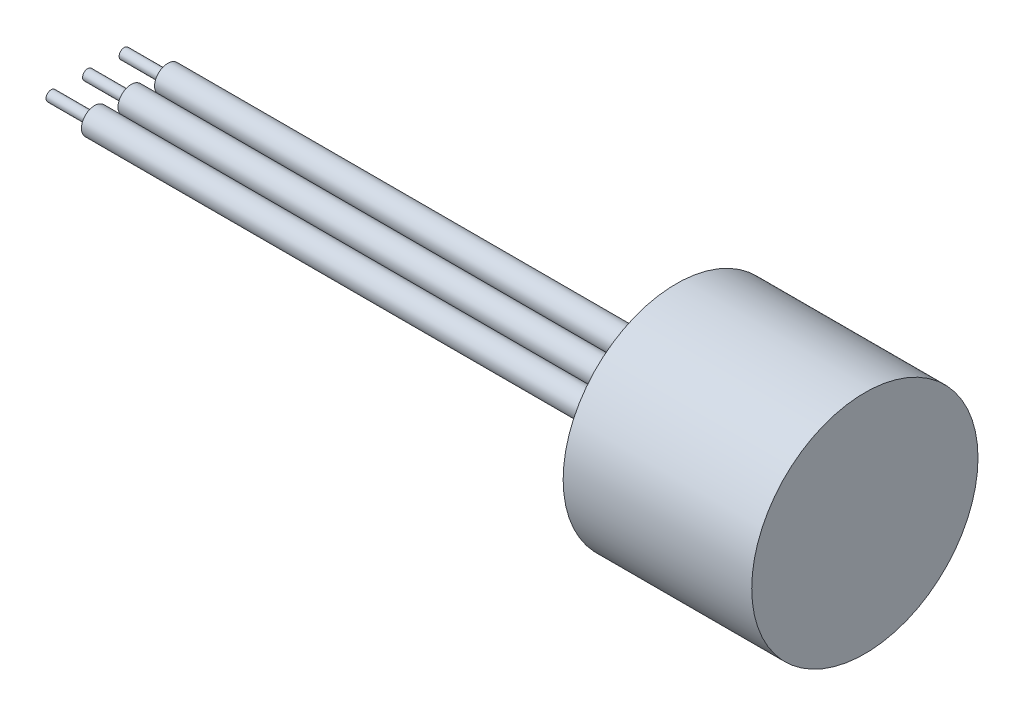
ISO-10303-21;
HEADER;
FILE_DESCRIPTION(('STEP AP214'),'2;1');
FILE_NAME('part.step','',(''),(''),'','','');
FILE_SCHEMA(('AUTOMOTIVE_DESIGN { 1 0 10303 214 1 1 1 1 }'));
ENDSEC;
DATA;
#1=APPLICATION_CONTEXT('core data for automotive mechanical design processes');
#2=APPLICATION_PROTOCOL_DEFINITION('international standard','automotive_design',2000,#1);
#3=PRODUCT_CONTEXT('',#1,'mechanical');
#4=PRODUCT('Part','Part','',(#3));
#5=PRODUCT_RELATED_PRODUCT_CATEGORY('part','',(#4));
#6=PRODUCT_DEFINITION_FORMATION('','',#4);
#7=PRODUCT_DEFINITION_CONTEXT('part definition',#1,'design');
#8=PRODUCT_DEFINITION('design','',#6,#7);
#9=PRODUCT_DEFINITION_SHAPE('','',#8);
#10=(LENGTH_UNIT() NAMED_UNIT(*) SI_UNIT(.MILLI.,.METRE.));
#11=(NAMED_UNIT(*) PLANE_ANGLE_UNIT() SI_UNIT($,.RADIAN.));
#12=(NAMED_UNIT(*) SI_UNIT($,.STERADIAN.) SOLID_ANGLE_UNIT());
#13=UNCERTAINTY_MEASURE_WITH_UNIT(LENGTH_MEASURE(1.E-05),#10,'distance_accuracy_value','');
#14=(GEOMETRIC_REPRESENTATION_CONTEXT(3) GLOBAL_UNCERTAINTY_ASSIGNED_CONTEXT((#13)) GLOBAL_UNIT_ASSIGNED_CONTEXT((#10,
#11,#12)) REPRESENTATION_CONTEXT('',''));
#15=CARTESIAN_POINT('',(0.,0.,0.));
#16=DIRECTION('',(0.,0.,1.));
#17=DIRECTION('',(1.,0.,0.));
#18=AXIS2_PLACEMENT_3D('',#15,#16,#17);
#19=CARTESIAN_POINT('',(35.6108,-12.191773113498,-0.094209599722346));
#20=DIRECTION('',(1.,0.,0.));
#21=DIRECTION('',(0.,0.,-1.));
#22=AXIS2_PLACEMENT_3D('',#19,#20,#21);
#23=PLANE('',#22);
#24=CARTESIAN_POINT('',(35.6108,-12.191772950524,-0.094209599722354));
#25=DIRECTION('',(1.,0.,0.));
#26=DIRECTION('',(0.,0.,-1.));
#27=AXIS2_PLACEMENT_3D('',#24,#25,#26);
#28=CIRCLE('',#27,1.46049991140565);
#29=CARTESIAN_POINT('',(35.6108,-12.191772950524,-1.554709511128));
#30=VERTEX_POINT('',#29);
#31=EDGE_CURVE('E10',#30,#30,#28,.F.);
#32=ORIENTED_EDGE('',*,*,#31,.F.);
#33=EDGE_LOOP('',(#32));
#34=FACE_BOUND('',#33,.T.);
#35=CARTESIAN_POINT('',(35.6108,-12.191772950524,-4.1582095997224));
#36=DIRECTION('',(1.,0.,0.));
#37=DIRECTION('',(0.,0.,-1.));
#38=AXIS2_PLACEMENT_3D('',#35,#36,#37);
#39=CIRCLE('',#38,1.46049991202145);
#40=CARTESIAN_POINT('',(35.6108,-12.191772950524,-5.61870951174385));
#41=VERTEX_POINT('',#40);
#42=EDGE_CURVE('E36',#41,#41,#39,.F.);
#43=ORIENTED_EDGE('',*,*,#42,.F.);
#44=EDGE_LOOP('',(#43));
#45=FACE_BOUND('',#44,.T.);
#46=CARTESIAN_POINT('',(35.6108,-12.191772950524,3.9697904002776));
#47=DIRECTION('',(1.,0.,0.));
#48=DIRECTION('',(0.,0.,-1.));
#49=AXIS2_PLACEMENT_3D('',#46,#47,#48);
#50=CIRCLE('',#49,1.46049991140565);
#51=CARTESIAN_POINT('',(35.6108,-12.191772950524,2.50929048887195));
#52=VERTEX_POINT('',#51);
#53=EDGE_CURVE('E40',#52,#52,#50,.F.);
#54=ORIENTED_EDGE('',*,*,#53,.F.);
#55=EDGE_LOOP('',(#54));
#56=FACE_BOUND('',#55,.T.);
#57=CARTESIAN_POINT('',(35.6108,-12.191773113498,-0.094209599722346));
#58=DIRECTION('',(-1.,0.,0.));
#59=DIRECTION('',(0.,0.,1.));
#60=AXIS2_PLACEMENT_3D('',#57,#58,#59);
#61=CIRCLE('',#60,7.1113758326624);
#62=CARTESIAN_POINT('',(35.6108,-12.191773113498,7.01716623294005));
#63=VERTEX_POINT('',#62);
#64=EDGE_CURVE('E44',#63,#63,#61,.T.);
#65=ORIENTED_EDGE('',*,*,#64,.T.);
#66=EDGE_LOOP('',(#65));
#67=FACE_BOUND('',#66,.T.);
#68=ADVANCED_FACE('F30',(#34,#45,#56,#67),#23,.F.);
#69=CARTESIAN_POINT('',(58.4708,-12.191773113498,-0.094209599722346));
#70=DIRECTION('',(-1.,0.,0.));
#71=DIRECTION('',(0.,0.,1.));
#72=AXIS2_PLACEMENT_3D('',#69,#70,#71);
#73=CYLINDRICAL_SURFACE('',#72,7.11137599563645);
#74=ORIENTED_EDGE('',*,*,#64,.F.);
#75=EDGE_LOOP('',(#74));
#76=FACE_BOUND('',#75,.T.);
#77=CARTESIAN_POINT('',(54.6608,-12.191773113498,-0.094209599722346));
#78=DIRECTION('',(-1.,0.,0.));
#79=DIRECTION('',(0.,0.,1.));
#80=AXIS2_PLACEMENT_3D('',#77,#78,#79);
#81=CIRCLE('',#80,7.1113761586105);
#82=CARTESIAN_POINT('',(54.6608,-12.191773113498,7.01716655888815));
#83=VERTEX_POINT('',#82);
#84=EDGE_CURVE('E49',#83,#83,#81,.T.);
#85=ORIENTED_EDGE('',*,*,#84,.T.);
#86=EDGE_LOOP('',(#85));
#87=FACE_BOUND('',#86,.T.);
#88=ADVANCED_FACE('F107',(#76,#87),#73,.T.);
#89=CARTESIAN_POINT('',(54.6608,-5.0803969548875,-0.094209599722346));
#90=DIRECTION('',(1.,0.,0.));
#91=DIRECTION('',(0.,0.,-1.));
#92=AXIS2_PLACEMENT_3D('',#89,#90,#91);
#93=PLANE('',#92);
#94=ORIENTED_EDGE('',*,*,#84,.F.);
#95=EDGE_LOOP('',(#94));
#96=FACE_BOUND('',#95,.T.);
#97=CARTESIAN_POINT('',(54.6608,-12.191773113498,-0.094209599722346));
#98=DIRECTION('',(-1.,0.,0.));
#99=DIRECTION('',(0.,0.,1.));
#100=AXIS2_PLACEMENT_3D('',#97,#98,#99);
#101=CIRCLE('',#100,9.3975179663575);
#102=CARTESIAN_POINT('',(54.6608,-12.191773113498,9.30330836663515));
#103=VERTEX_POINT('',#102);
#104=EDGE_CURVE('E52',#103,#103,#101,.T.);
#105=ORIENTED_EDGE('',*,*,#104,.T.);
#106=EDGE_LOOP('',(#105));
#107=FACE_BOUND('',#106,.T.);
#108=ADVANCED_FACE('F112',(#96,#107),#93,.F.);
#109=CARTESIAN_POINT('',(58.4708,-12.191773113498,-0.094209599722346));
#110=DIRECTION('',(-1.,0.,0.));
#111=DIRECTION('',(0.,0.,1.));
#112=AXIS2_PLACEMENT_3D('',#109,#110,#111);
#113=CYLINDRICAL_SURFACE('',#112,9.39752295933295);
#114=ORIENTED_EDGE('',*,*,#104,.F.);
#115=EDGE_LOOP('',(#114));
#116=FACE_BOUND('',#115,.T.);
#117=CARTESIAN_POINT('',(39.0398,-12.191773113498,-0.094209599722346));
#118=DIRECTION('',(-1.,0.,0.));
#119=DIRECTION('',(0.,0.,1.));
#120=AXIS2_PLACEMENT_3D('',#117,#118,#119);
#121=CIRCLE('',#120,9.3975279523084);
#122=CARTESIAN_POINT('',(39.0398,-12.191773113498,9.30331835258605));
#123=VERTEX_POINT('',#122);
#124=EDGE_CURVE('E55',#123,#123,#121,.T.);
#125=ORIENTED_EDGE('',*,*,#124,.T.);
#126=EDGE_LOOP('',(#125));
#127=FACE_BOUND('',#126,.T.);
#128=ADVANCED_FACE('F124',(#116,#127),#113,.F.);
#129=CARTESIAN_POINT('',(37.5158,-12.191773113498,-0.094209599722346));
#130=DIRECTION('',(-1.,0.,0.));
#131=DIRECTION('',(0.,0.,1.));
#132=AXIS2_PLACEMENT_3D('',#129,#130,#131);
#133=CONICAL_SURFACE('',#132,10.9215842029962,0.785416618006934);
#134=ORIENTED_EDGE('',*,*,#124,.F.);
#135=EDGE_LOOP('',(#134));
#136=FACE_BOUND('',#135,.T.);
#137=CARTESIAN_POINT('',(37.5158,-12.191773113498,-0.094209599722346));
#138=DIRECTION('',(-1.,0.,0.));
#139=DIRECTION('',(0.,0.,1.));
#140=AXIS2_PLACEMENT_3D('',#137,#138,#139);
#141=CIRCLE('',#140,10.9215842029962);
#142=CARTESIAN_POINT('',(37.5158,-12.191773113498,10.8273746032739));
#143=VERTEX_POINT('',#142);
#144=EDGE_CURVE('E58',#143,#143,#141,.T.);
#145=ORIENTED_EDGE('',*,*,#144,.T.);
#146=EDGE_LOOP('',(#145));
#147=FACE_BOUND('',#146,.T.);
#148=ADVANCED_FACE('F130',(#136,#147),#133,.F.);
#149=CARTESIAN_POINT('',(37.5158,-1.2701889105018,-0.094209599722346));
#150=DIRECTION('',(1.,0.,0.));
#151=DIRECTION('',(0.,0.,-1.));
#152=AXIS2_PLACEMENT_3D('',#149,#150,#151);
#153=PLANE('',#152);
#154=ORIENTED_EDGE('',*,*,#144,.F.);
#155=EDGE_LOOP('',(#154));
#156=FACE_BOUND('',#155,.T.);
#157=CARTESIAN_POINT('',(37.5158,-12.191773113498,-0.094209599722346));
#158=DIRECTION('',(-1.,0.,0.));
#159=DIRECTION('',(0.,0.,1.));
#160=AXIS2_PLACEMENT_3D('',#157,#158,#159);
#161=CIRCLE('',#160,12.5726472013391);
#162=CARTESIAN_POINT('',(37.5158,-12.191773113498,12.4784376016168));
#163=VERTEX_POINT('',#162);
#164=EDGE_CURVE('E61',#163,#163,#161,.T.);
#165=ORIENTED_EDGE('',*,*,#164,.T.);
#166=EDGE_LOOP('',(#165));
#167=FACE_BOUND('',#166,.T.);
#168=ADVANCED_FACE('F136',(#156,#167),#153,.F.);
#169=CARTESIAN_POINT('',(58.4708,-12.191773113498,-0.094209599722346));
#170=DIRECTION('',(-1.,0.,0.));
#171=DIRECTION('',(0.,0.,1.));
#172=AXIS2_PLACEMENT_3D('',#169,#170,#171);
#173=CYLINDRICAL_SURFACE('',#172,12.5726429464427);
#174=ORIENTED_EDGE('',*,*,#164,.F.);
#175=EDGE_LOOP('',(#174));
#176=FACE_BOUND('',#175,.T.);
#177=CARTESIAN_POINT('',(58.4708,-12.191773113498,-0.094209599722346));
#178=DIRECTION('',(-1.,0.,0.));
#179=DIRECTION('',(0.,0.,1.));
#180=AXIS2_PLACEMENT_3D('',#177,#178,#179);
#181=CIRCLE('',#180,12.5726386915462);
#182=CARTESIAN_POINT('',(58.4708,-12.191773113498,12.4784290918239));
#183=VERTEX_POINT('',#182);
#184=EDGE_CURVE('E64',#183,#183,#181,.T.);
#185=ORIENTED_EDGE('',*,*,#184,.T.);
#186=EDGE_LOOP('',(#185));
#187=FACE_BOUND('',#186,.T.);
#188=ADVANCED_FACE('F142',(#176,#187),#173,.T.);
#189=CARTESIAN_POINT('',(58.4708,0.38086557804821,-0.094209599722346));
#190=DIRECTION('',(-1.,0.,0.));
#191=DIRECTION('',(0.,0.,1.));
#192=AXIS2_PLACEMENT_3D('',#189,#190,#191);
#193=PLANE('',#192);
#194=ORIENTED_EDGE('',*,*,#184,.F.);
#195=EDGE_LOOP('',(#194));
#196=FACE_BOUND('',#195,.T.);
#197=ADVANCED_FACE('F148',(#196),#193,.F.);
#198=CARTESIAN_POINT('',(-27.8892,-12.191772950524,3.9697904002777));
#199=DIRECTION('',(1.,0.,0.));
#200=DIRECTION('',(0.,0.,-1.));
#201=AXIS2_PLACEMENT_3D('',#198,#199,#200);
#202=PLANE('',#201);
#203=CARTESIAN_POINT('',(-27.8892,-12.191772950524,3.9697904002777));
#204=DIRECTION('',(-1.,0.,0.));
#205=DIRECTION('',(0.,0.,1.));
#206=AXIS2_PLACEMENT_3D('',#203,#204,#205);
#207=CIRCLE('',#206,0.5715);
#208=CARTESIAN_POINT('',(-27.8892,-12.191772950524,4.5412904002777));
#209=VERTEX_POINT('',#208);
#210=EDGE_CURVE('E67',#209,#209,#207,.T.);
#211=ORIENTED_EDGE('',*,*,#210,.T.);
#212=EDGE_LOOP('',(#211));
#213=FACE_BOUND('',#212,.T.);
#214=ADVANCED_FACE('F153',(#213),#202,.F.);
#215=CARTESIAN_POINT('',(35.6108,-12.191772950524,3.9697904002776));
#216=DIRECTION('',(-1.,0.,0.));
#217=DIRECTION('',(0.,0.,1.));
#218=AXIS2_PLACEMENT_3D('',#215,#216,#217);
#219=CYLINDRICAL_SURFACE('',#218,0.571499999999996);
#220=ORIENTED_EDGE('',*,*,#210,.F.);
#221=EDGE_LOOP('',(#220));
#222=FACE_BOUND('',#221,.T.);
#223=CARTESIAN_POINT('',(-23.0632,-12.191772950524,3.96979040027769));
#224=DIRECTION('',(-1.,0.,0.));
#225=DIRECTION('',(0.,0.,1.));
#226=AXIS2_PLACEMENT_3D('',#223,#224,#225);
#227=CIRCLE('',#226,0.571499999999992);
#228=CARTESIAN_POINT('',(-23.0632,-12.191772950524,4.54129040027768));
#229=VERTEX_POINT('',#228);
#230=EDGE_CURVE('E70',#229,#229,#227,.T.);
#231=ORIENTED_EDGE('',*,*,#230,.T.);
#232=EDGE_LOOP('',(#231));
#233=FACE_BOUND('',#232,.T.);
#234=ADVANCED_FACE('F158',(#222,#233),#219,.T.);
#235=CARTESIAN_POINT('',(-23.0632,-12.191772950524,3.3982904002777));
#236=DIRECTION('',(1.,0.,0.));
#237=DIRECTION('',(0.,0.,-1.));
#238=AXIS2_PLACEMENT_3D('',#235,#236,#237);
#239=PLANE('',#238);
#240=ORIENTED_EDGE('',*,*,#230,.F.);
#241=EDGE_LOOP('',(#240));
#242=FACE_BOUND('',#241,.T.);
#243=CARTESIAN_POINT('',(-23.0632,-12.191772950524,3.96979040027769));
#244=DIRECTION('',(-1.,0.,0.));
#245=DIRECTION('',(0.,0.,1.));
#246=AXIS2_PLACEMENT_3D('',#243,#244,#245);
#247=CIRCLE('',#246,1.46049991140569);
#248=CARTESIAN_POINT('',(-23.0632,-12.191772950524,5.43029031168338));
#249=VERTEX_POINT('',#248);
#250=EDGE_CURVE('E73',#249,#249,#247,.T.);
#251=ORIENTED_EDGE('',*,*,#250,.T.);
#252=EDGE_LOOP('',(#251));
#253=FACE_BOUND('',#252,.T.);
#254=ADVANCED_FACE('F164',(#242,#253),#239,.F.);
#255=CARTESIAN_POINT('',(35.6108,-12.191772950524,3.9697904002776));
#256=DIRECTION('',(-1.,0.,0.));
#257=DIRECTION('',(0.,0.,1.));
#258=AXIS2_PLACEMENT_3D('',#255,#256,#257);
#259=CYLINDRICAL_SURFACE('',#258,1.46049991140565);
#260=ORIENTED_EDGE('',*,*,#250,.F.);
#261=EDGE_LOOP('',(#260));
#262=FACE_BOUND('',#261,.T.);
#263=ORIENTED_EDGE('',*,*,#53,.T.);
#264=EDGE_LOOP('',(#263));
#265=FACE_BOUND('',#264,.T.);
#266=ADVANCED_FACE('F168',(#262,#265),#259,.T.);
#267=CARTESIAN_POINT('',(-27.8892,-12.191772950524,-4.1582095997223));
#268=DIRECTION('',(1.,0.,0.));
#269=DIRECTION('',(0.,0.,-1.));
#270=AXIS2_PLACEMENT_3D('',#267,#268,#269);
#271=PLANE('',#270);
#272=CARTESIAN_POINT('',(-27.8892,-12.191772950524,-4.1582095997223));
#273=DIRECTION('',(-1.,0.,0.));
#274=DIRECTION('',(0.,0.,1.));
#275=AXIS2_PLACEMENT_3D('',#272,#273,#274);
#276=CIRCLE('',#275,0.5715);
#277=CARTESIAN_POINT('',(-27.8892,-12.191772950524,-3.5867095997223));
#278=VERTEX_POINT('',#277);
#279=EDGE_CURVE('E76',#278,#278,#276,.T.);
#280=ORIENTED_EDGE('',*,*,#279,.T.);
#281=EDGE_LOOP('',(#280));
#282=FACE_BOUND('',#281,.T.);
#283=ADVANCED_FACE('F172',(#282),#271,.F.);
#284=CARTESIAN_POINT('',(35.6108,-12.191772950524,-4.1582095997224));
#285=DIRECTION('',(-1.,0.,0.));
#286=DIRECTION('',(0.,0.,1.));
#287=AXIS2_PLACEMENT_3D('',#284,#285,#286);
#288=CYLINDRICAL_SURFACE('',#287,0.571499999999996);
#289=ORIENTED_EDGE('',*,*,#279,.F.);
#290=EDGE_LOOP('',(#289));
#291=FACE_BOUND('',#290,.T.);
#292=CARTESIAN_POINT('',(-23.0632,-12.191772950524,-4.15820959972231));
#293=DIRECTION('',(-1.,0.,0.));
#294=DIRECTION('',(0.,0.,1.));
#295=AXIS2_PLACEMENT_3D('',#292,#293,#294);
#296=CIRCLE('',#295,0.571499999999992);
#297=CARTESIAN_POINT('',(-23.0632,-12.191772950524,-3.58670959972232));
#298=VERTEX_POINT('',#297);
#299=EDGE_CURVE('E79',#298,#298,#296,.T.);
#300=ORIENTED_EDGE('',*,*,#299,.T.);
#301=EDGE_LOOP('',(#300));
#302=FACE_BOUND('',#301,.T.);
#303=ADVANCED_FACE('F176',(#291,#302),#288,.T.);
#304=CARTESIAN_POINT('',(-23.0632,-12.191772950524,-4.7297095997223));
#305=DIRECTION('',(1.,0.,0.));
#306=DIRECTION('',(0.,0.,-1.));
#307=AXIS2_PLACEMENT_3D('',#304,#305,#306);
#308=PLANE('',#307);
#309=ORIENTED_EDGE('',*,*,#299,.F.);
#310=EDGE_LOOP('',(#309));
#311=FACE_BOUND('',#310,.T.);
#312=CARTESIAN_POINT('',(-23.0632,-12.191772950524,-4.15820959972231));
#313=DIRECTION('',(-1.,0.,0.));
#314=DIRECTION('',(0.,0.,1.));
#315=AXIS2_PLACEMENT_3D('',#312,#313,#314);
#316=CIRCLE('',#315,1.46049991202149);
#317=CARTESIAN_POINT('',(-23.0632,-12.191772950524,-2.69770968770082));
#318=VERTEX_POINT('',#317);
#319=EDGE_CURVE('E82',#318,#318,#316,.T.);
#320=ORIENTED_EDGE('',*,*,#319,.T.);
#321=EDGE_LOOP('',(#320));
#322=FACE_BOUND('',#321,.T.);
#323=ADVANCED_FACE('F180',(#311,#322),#308,.F.);
#324=CARTESIAN_POINT('',(35.6108,-12.191772950524,-4.1582095997224));
#325=DIRECTION('',(-1.,0.,0.));
#326=DIRECTION('',(0.,0.,1.));
#327=AXIS2_PLACEMENT_3D('',#324,#325,#326);
#328=CYLINDRICAL_SURFACE('',#327,1.46049991202145);
#329=ORIENTED_EDGE('',*,*,#319,.F.);
#330=EDGE_LOOP('',(#329));
#331=FACE_BOUND('',#330,.T.);
#332=ORIENTED_EDGE('',*,*,#42,.T.);
#333=EDGE_LOOP('',(#332));
#334=FACE_BOUND('',#333,.T.);
#335=ADVANCED_FACE('F184',(#331,#334),#328,.T.);
#336=CARTESIAN_POINT('',(-27.8892,-12.191772950524,-0.094209599722346));
#337=DIRECTION('',(1.,0.,0.));
#338=DIRECTION('',(0.,0.,-1.));
#339=AXIS2_PLACEMENT_3D('',#336,#337,#338);
#340=PLANE('',#339);
#341=CARTESIAN_POINT('',(-27.8892,-12.191772950524,-0.094209599722346));
#342=DIRECTION('',(-1.,0.,0.));
#343=DIRECTION('',(0.,0.,1.));
#344=AXIS2_PLACEMENT_3D('',#341,#342,#343);
#345=CIRCLE('',#344,0.571500000000004);
#346=CARTESIAN_POINT('',(-27.8892,-12.191772950524,0.477290400277658));
#347=VERTEX_POINT('',#346);
#348=EDGE_CURVE('E85',#347,#347,#345,.T.);
#349=ORIENTED_EDGE('',*,*,#348,.T.);
#350=EDGE_LOOP('',(#349));
#351=FACE_BOUND('',#350,.T.);
#352=ADVANCED_FACE('F188',(#351),#340,.F.);
#353=CARTESIAN_POINT('',(35.6108,-12.191772950524,-0.094209599722354));
#354=DIRECTION('',(-1.,0.,0.));
#355=DIRECTION('',(0.,0.,1.));
#356=AXIS2_PLACEMENT_3D('',#353,#354,#355);
#357=CYLINDRICAL_SURFACE('',#356,0.571500000000004);
#358=ORIENTED_EDGE('',*,*,#348,.F.);
#359=EDGE_LOOP('',(#358));
#360=FACE_BOUND('',#359,.T.);
#361=CARTESIAN_POINT('',(-23.0632,-12.191772950524,-0.0942095997223466));
#362=DIRECTION('',(-1.,0.,0.));
#363=DIRECTION('',(0.,0.,1.));
#364=AXIS2_PLACEMENT_3D('',#361,#362,#363);
#365=CIRCLE('',#364,0.571500000000003);
#366=CARTESIAN_POINT('',(-23.0632,-12.191772950524,0.477290400277657));
#367=VERTEX_POINT('',#366);
#368=EDGE_CURVE('E88',#367,#367,#365,.T.);
#369=ORIENTED_EDGE('',*,*,#368,.T.);
#370=EDGE_LOOP('',(#369));
#371=FACE_BOUND('',#370,.T.);
#372=ADVANCED_FACE('F103',(#360,#371),#357,.T.);
#373=CARTESIAN_POINT('',(-23.0632,-12.191772950524,-0.66570959972235));
#374=DIRECTION('',(1.,0.,0.));
#375=DIRECTION('',(0.,0.,-1.));
#376=AXIS2_PLACEMENT_3D('',#373,#374,#375);
#377=PLANE('',#376);
#378=ORIENTED_EDGE('',*,*,#368,.F.);
#379=EDGE_LOOP('',(#378));
#380=FACE_BOUND('',#379,.T.);
#381=CARTESIAN_POINT('',(-23.0632,-12.191772950524,-0.0942095997223466));
#382=DIRECTION('',(-1.,0.,0.));
#383=DIRECTION('',(0.,0.,1.));
#384=AXIS2_PLACEMENT_3D('',#381,#382,#383);
#385=CIRCLE('',#384,1.46049991140565);
#386=CARTESIAN_POINT('',(-23.0632,-12.191772950524,1.36629031168331));
#387=VERTEX_POINT('',#386);
#388=EDGE_CURVE('E91',#387,#387,#385,.T.);
#389=ORIENTED_EDGE('',*,*,#388,.T.);
#390=EDGE_LOOP('',(#389));
#391=FACE_BOUND('',#390,.T.);
#392=ADVANCED_FACE('F95',(#380,#391),#377,.F.);
#393=CARTESIAN_POINT('',(35.6108,-12.191772950524,-0.094209599722354));
#394=DIRECTION('',(-1.,0.,0.));
#395=DIRECTION('',(0.,0.,1.));
#396=AXIS2_PLACEMENT_3D('',#393,#394,#395);
#397=CYLINDRICAL_SURFACE('',#396,1.46049991140565);
#398=ORIENTED_EDGE('',*,*,#388,.F.);
#399=EDGE_LOOP('',(#398));
#400=FACE_BOUND('',#399,.T.);
#401=ORIENTED_EDGE('',*,*,#31,.T.);
#402=EDGE_LOOP('',(#401));
#403=FACE_BOUND('',#402,.T.);
#404=ADVANCED_FACE('F97',(#400,#403),#397,.T.);
#405=CLOSED_SHELL('',(#68,#88,#108,#128,#148,#168,#188,#197,#214,#234,#254,#266,#283,#303,#323,
#335,#352,#372,#392,#404));
#406=MANIFOLD_SOLID_BREP('B2',#405);
#407=ADVANCED_BREP_SHAPE_REPRESENTATION('',(#18,#406),#14);
#408=SHAPE_DEFINITION_REPRESENTATION(#9,#407);
ENDSEC;
END-ISO-10303-21;
